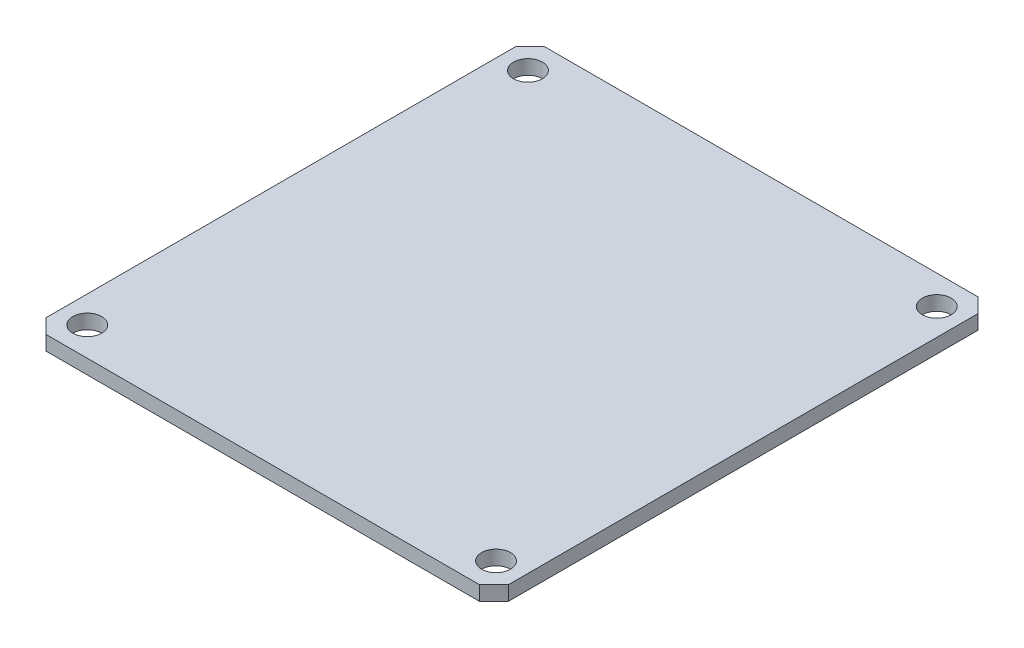
ISO-10303-21;
HEADER;
FILE_DESCRIPTION(('STEP AP214'),'2;1');
FILE_NAME('part.step','',(''),(''),'','','');
FILE_SCHEMA(('AUTOMOTIVE_DESIGN { 1 0 10303 214 1 1 1 1 }'));
ENDSEC;
DATA;
#1=APPLICATION_CONTEXT('core data for automotive mechanical design processes');
#2=APPLICATION_PROTOCOL_DEFINITION('international standard','automotive_design',2000,#1);
#3=PRODUCT_CONTEXT('',#1,'mechanical');
#4=PRODUCT('Part','Part','',(#3));
#5=PRODUCT_RELATED_PRODUCT_CATEGORY('part','',(#4));
#6=PRODUCT_DEFINITION_FORMATION('','',#4);
#7=PRODUCT_DEFINITION_CONTEXT('part definition',#1,'design');
#8=PRODUCT_DEFINITION('design','',#6,#7);
#9=PRODUCT_DEFINITION_SHAPE('','',#8);
#10=(LENGTH_UNIT() NAMED_UNIT(*) SI_UNIT(.MILLI.,.METRE.));
#11=(NAMED_UNIT(*) PLANE_ANGLE_UNIT() SI_UNIT($,.RADIAN.));
#12=(NAMED_UNIT(*) SI_UNIT($,.STERADIAN.) SOLID_ANGLE_UNIT());
#13=UNCERTAINTY_MEASURE_WITH_UNIT(LENGTH_MEASURE(1.E-05),#10,'distance_accuracy_value','');
#14=(GEOMETRIC_REPRESENTATION_CONTEXT(3) GLOBAL_UNCERTAINTY_ASSIGNED_CONTEXT((#13)) GLOBAL_UNIT_ASSIGNED_CONTEXT((#10,
#11,#12)) REPRESENTATION_CONTEXT('',''));
#15=CARTESIAN_POINT('',(0.,0.,0.));
#16=DIRECTION('',(0.,0.,1.));
#17=DIRECTION('',(1.,0.,0.));
#18=AXIS2_PLACEMENT_3D('',#15,#16,#17);
#19=CARTESIAN_POINT('',(0.,2.,0.));
#20=DIRECTION('',(0.,-1.,0.));
#21=DIRECTION('',(0.,0.,-1.));
#22=AXIS2_PLACEMENT_3D('',#19,#20,#21);
#23=PLANE('',#22);
#24=DIRECTION('',(0.,0.,1.));
#25=VECTOR('',#24,1.);
#26=CARTESIAN_POINT('',(-32.,2.,32.5));
#27=LINE('',#26,#25);
#28=CARTESIAN_POINT('',(-32.,2.,-32.5003020228044));
#29=VERTEX_POINT('',#28);
#30=CARTESIAN_POINT('',(-32.,2.,32.5));
#31=VERTEX_POINT('',#30);
#32=EDGE_CURVE('E144',#29,#31,#27,.T.);
#33=ORIENTED_EDGE('',*,*,#32,.T.);
#34=DIRECTION('',(0.707106781186546,0.,0.707106781186549));
#35=VECTOR('',#34,1.);
#36=CARTESIAN_POINT('',(-32.,2.,32.5));
#37=LINE('',#36,#35);
#38=CARTESIAN_POINT('',(-30.,2.,34.5));
#39=VERTEX_POINT('',#38);
#40=EDGE_CURVE('E92',#31,#39,#37,.T.);
#41=ORIENTED_EDGE('',*,*,#40,.T.);
#42=DIRECTION('',(1.,0.,0.));
#43=VECTOR('',#42,1.);
#44=CARTESIAN_POINT('',(-30.,2.,34.5));
#45=LINE('',#44,#43);
#46=CARTESIAN_POINT('',(30.,2.,34.5));
#47=VERTEX_POINT('',#46);
#48=EDGE_CURVE('E159',#39,#47,#45,.T.);
#49=ORIENTED_EDGE('',*,*,#48,.T.);
#50=DIRECTION('',(0.707106781186546,0.,-0.707106781186549));
#51=VECTOR('',#50,1.);
#52=CARTESIAN_POINT('',(30.,2.,34.5));
#53=LINE('',#52,#51);
#54=CARTESIAN_POINT('',(32.,2.,32.5));
#55=VERTEX_POINT('',#54);
#56=EDGE_CURVE('E172',#47,#55,#53,.T.);
#57=ORIENTED_EDGE('',*,*,#56,.T.);
#58=DIRECTION('',(0.,0.,-1.));
#59=VECTOR('',#58,1.);
#60=CARTESIAN_POINT('',(32.,2.,32.5));
#61=LINE('',#60,#59);
#62=CARTESIAN_POINT('',(32.,2.,-32.5));
#63=VERTEX_POINT('',#62);
#64=EDGE_CURVE('E111',#55,#63,#61,.T.);
#65=ORIENTED_EDGE('',*,*,#64,.T.);
#66=DIRECTION('',(-0.707106781186549,0.,-0.707106781186546));
#67=VECTOR('',#66,1.);
#68=CARTESIAN_POINT('',(30.,2.,-34.5));
#69=LINE('',#68,#67);
#70=CARTESIAN_POINT('',(30.,2.,-34.5));
#71=VERTEX_POINT('',#70);
#72=EDGE_CURVE('E105',#63,#71,#69,.T.);
#73=ORIENTED_EDGE('',*,*,#72,.T.);
#74=DIRECTION('',(-1.,0.,0.));
#75=VECTOR('',#74,1.);
#76=CARTESIAN_POINT('',(-30.0003020228045,2.,-34.5));
#77=LINE('',#76,#75);
#78=CARTESIAN_POINT('',(-30.0003020228045,2.,-34.5));
#79=VERTEX_POINT('',#78);
#80=EDGE_CURVE('E109',#71,#79,#77,.T.);
#81=ORIENTED_EDGE('',*,*,#80,.T.);
#82=DIRECTION('',(-0.707106781186544,0.,0.707106781186551));
#83=VECTOR('',#82,1.);
#84=CARTESIAN_POINT('',(-32.,2.,-32.5003020228044));
#85=LINE('',#84,#83);
#86=EDGE_CURVE('E49',#79,#29,#85,.T.);
#87=ORIENTED_EDGE('',*,*,#86,.T.);
#88=EDGE_LOOP('',(#33,#41,#49,#57,#65,#73,#81,#87));
#89=FACE_BOUND('',#88,.T.);
#90=CARTESIAN_POINT('',(-28.2898550724638,2.,-30.5));
#91=DIRECTION('',(0.,1.,0.));
#92=DIRECTION('',(0.,0.,1.));
#93=AXIS2_PLACEMENT_3D('',#90,#91,#92);
#94=CIRCLE('',#93,2.);
#95=CARTESIAN_POINT('',(-28.2898550724638,2.,-28.5));
#96=VERTEX_POINT('',#95);
#97=EDGE_CURVE('E133',#96,#96,#94,.T.);
#98=ORIENTED_EDGE('',*,*,#97,.F.);
#99=EDGE_LOOP('',(#98));
#100=FACE_BOUND('',#99,.T.);
#101=CARTESIAN_POINT('',(28.2895705579567,2.,-30.5001238280928));
#102=DIRECTION('',(0.,1.,0.));
#103=DIRECTION('',(0.,0.,-1.));
#104=AXIS2_PLACEMENT_3D('',#101,#102,#103);
#105=CIRCLE('',#104,2.00000000000001);
#106=CARTESIAN_POINT('',(28.2895705579567,2.,-32.5001238280928));
#107=VERTEX_POINT('',#106);
#108=EDGE_CURVE('E181',#107,#107,#105,.T.);
#109=ORIENTED_EDGE('',*,*,#108,.F.);
#110=EDGE_LOOP('',(#109));
#111=FACE_BOUND('',#110,.T.);
#112=CARTESIAN_POINT('',(-28.2899990045352,2.,30.4997154854243));
#113=DIRECTION('',(0.,1.,0.));
#114=DIRECTION('',(0.,0.,-1.));
#115=AXIS2_PLACEMENT_3D('',#112,#113,#114);
#116=CIRCLE('',#115,2.);
#117=CARTESIAN_POINT('',(-28.2899990045352,2.,28.4997154854243));
#118=VERTEX_POINT('',#117);
#119=EDGE_CURVE('E187',#118,#118,#116,.T.);
#120=ORIENTED_EDGE('',*,*,#119,.F.);
#121=EDGE_LOOP('',(#120));
#122=FACE_BOUND('',#121,.T.);
#123=CARTESIAN_POINT('',(28.2894266246709,2.,30.5001063178421));
#124=DIRECTION('',(0.,1.,0.));
#125=DIRECTION('',(0.,0.,1.));
#126=AXIS2_PLACEMENT_3D('',#123,#124,#125);
#127=CIRCLE('',#126,2.00000000000001);
#128=CARTESIAN_POINT('',(28.2894266246709,2.,32.5001063178421));
#129=VERTEX_POINT('',#128);
#130=EDGE_CURVE('E193',#129,#129,#127,.T.);
#131=ORIENTED_EDGE('',*,*,#130,.F.);
#132=EDGE_LOOP('',(#131));
#133=FACE_BOUND('',#132,.T.);
#134=ADVANCED_FACE('F32',(#89,#100,#111,#122,#133),#23,.F.);
#135=CARTESIAN_POINT('',(0.,0.,0.));
#136=DIRECTION('',(0.,-1.,0.));
#137=DIRECTION('',(0.,0.,-1.));
#138=AXIS2_PLACEMENT_3D('',#135,#136,#137);
#139=PLANE('',#138);
#140=CARTESIAN_POINT('',(-28.2899990045352,0.,30.4997154854243));
#141=DIRECTION('',(0.,1.,0.));
#142=DIRECTION('',(0.,0.,-1.));
#143=AXIS2_PLACEMENT_3D('',#140,#141,#142);
#144=CIRCLE('',#143,2.);
#145=CARTESIAN_POINT('',(-28.2899990045352,0.,28.4997154854243));
#146=VERTEX_POINT('',#145);
#147=EDGE_CURVE('E190',#146,#146,#144,.T.);
#148=ORIENTED_EDGE('',*,*,#147,.T.);
#149=EDGE_LOOP('',(#148));
#150=FACE_BOUND('',#149,.T.);
#151=CARTESIAN_POINT('',(-28.2898550724638,0.,-30.5));
#152=DIRECTION('',(0.,1.,0.));
#153=DIRECTION('',(0.,0.,1.));
#154=AXIS2_PLACEMENT_3D('',#151,#152,#153);
#155=CIRCLE('',#154,2.);
#156=CARTESIAN_POINT('',(-28.2898550724638,0.,-28.5));
#157=VERTEX_POINT('',#156);
#158=EDGE_CURVE('E178',#157,#157,#155,.T.);
#159=ORIENTED_EDGE('',*,*,#158,.T.);
#160=EDGE_LOOP('',(#159));
#161=FACE_BOUND('',#160,.T.);
#162=DIRECTION('',(0.,0.,1.));
#163=VECTOR('',#162,1.);
#164=CARTESIAN_POINT('',(-32.,0.,32.5));
#165=LINE('',#164,#163);
#166=CARTESIAN_POINT('',(-32.,0.,-32.5003020228044));
#167=VERTEX_POINT('',#166);
#168=CARTESIAN_POINT('',(-32.,0.,32.5));
#169=VERTEX_POINT('',#168);
#170=EDGE_CURVE('E129',#167,#169,#165,.T.);
#171=ORIENTED_EDGE('',*,*,#170,.F.);
#172=DIRECTION('',(-0.707106781186544,0.,0.707106781186551));
#173=VECTOR('',#172,1.);
#174=CARTESIAN_POINT('',(-32.,0.,-32.5003020228044));
#175=LINE('',#174,#173);
#176=CARTESIAN_POINT('',(-30.0003020228045,0.,-34.5));
#177=VERTEX_POINT('',#176);
#178=EDGE_CURVE('E84',#177,#167,#175,.T.);
#179=ORIENTED_EDGE('',*,*,#178,.F.);
#180=DIRECTION('',(-1.,0.,0.));
#181=VECTOR('',#180,1.);
#182=CARTESIAN_POINT('',(-30.0003020228045,0.,-34.5));
#183=LINE('',#182,#181);
#184=CARTESIAN_POINT('',(30.,0.,-34.5));
#185=VERTEX_POINT('',#184);
#186=EDGE_CURVE('E78',#185,#177,#183,.T.);
#187=ORIENTED_EDGE('',*,*,#186,.F.);
#188=DIRECTION('',(-0.707106781186549,0.,-0.707106781186546));
#189=VECTOR('',#188,1.);
#190=CARTESIAN_POINT('',(30.,0.,-34.5));
#191=LINE('',#190,#189);
#192=CARTESIAN_POINT('',(32.,0.,-32.5));
#193=VERTEX_POINT('',#192);
#194=EDGE_CURVE('E119',#193,#185,#191,.T.);
#195=ORIENTED_EDGE('',*,*,#194,.F.);
#196=DIRECTION('',(0.,0.,-1.));
#197=VECTOR('',#196,1.);
#198=CARTESIAN_POINT('',(32.,0.,32.5));
#199=LINE('',#198,#197);
#200=CARTESIAN_POINT('',(32.,0.,32.5));
#201=VERTEX_POINT('',#200);
#202=EDGE_CURVE('E139',#201,#193,#199,.T.);
#203=ORIENTED_EDGE('',*,*,#202,.F.);
#204=DIRECTION('',(0.707106781186546,0.,-0.707106781186549));
#205=VECTOR('',#204,1.);
#206=CARTESIAN_POINT('',(30.,0.,34.5));
#207=LINE('',#206,#205);
#208=CARTESIAN_POINT('',(30.,0.,34.5));
#209=VERTEX_POINT('',#208);
#210=EDGE_CURVE('E137',#209,#201,#207,.T.);
#211=ORIENTED_EDGE('',*,*,#210,.F.);
#212=DIRECTION('',(1.,0.,0.));
#213=VECTOR('',#212,1.);
#214=CARTESIAN_POINT('',(-30.,0.,34.5));
#215=LINE('',#214,#213);
#216=CARTESIAN_POINT('',(-30.,0.,34.5));
#217=VERTEX_POINT('',#216);
#218=EDGE_CURVE('E135',#217,#209,#215,.T.);
#219=ORIENTED_EDGE('',*,*,#218,.F.);
#220=DIRECTION('',(0.707106781186546,0.,0.707106781186549));
#221=VECTOR('',#220,1.);
#222=CARTESIAN_POINT('',(-32.,0.,32.5));
#223=LINE('',#222,#221);
#224=EDGE_CURVE('E132',#169,#217,#223,.T.);
#225=ORIENTED_EDGE('',*,*,#224,.F.);
#226=EDGE_LOOP('',(#171,#179,#187,#195,#203,#211,#219,#225));
#227=FACE_BOUND('',#226,.T.);
#228=CARTESIAN_POINT('',(28.2895705579567,0.,-30.5001238280928));
#229=DIRECTION('',(0.,1.,0.));
#230=DIRECTION('',(0.,0.,-1.));
#231=AXIS2_PLACEMENT_3D('',#228,#229,#230);
#232=CIRCLE('',#231,2.00000000000001);
#233=CARTESIAN_POINT('',(28.2895705579567,0.,-32.5001238280928));
#234=VERTEX_POINT('',#233);
#235=EDGE_CURVE('E184',#234,#234,#232,.T.);
#236=ORIENTED_EDGE('',*,*,#235,.T.);
#237=EDGE_LOOP('',(#236));
#238=FACE_BOUND('',#237,.T.);
#239=CARTESIAN_POINT('',(28.2894266246709,0.,30.5001063178421));
#240=DIRECTION('',(0.,1.,0.));
#241=DIRECTION('',(0.,0.,1.));
#242=AXIS2_PLACEMENT_3D('',#239,#240,#241);
#243=CIRCLE('',#242,2.00000000000001);
#244=CARTESIAN_POINT('',(28.2894266246709,0.,32.5001063178421));
#245=VERTEX_POINT('',#244);
#246=EDGE_CURVE('E196',#245,#245,#243,.T.);
#247=ORIENTED_EDGE('',*,*,#246,.T.);
#248=EDGE_LOOP('',(#247));
#249=FACE_BOUND('',#248,.T.);
#250=ADVANCED_FACE('F163',(#150,#161,#227,#238,#249),#139,.T.);
#251=CARTESIAN_POINT('',(-32.,2.,32.5));
#252=DIRECTION('',(1.,0.,0.));
#253=DIRECTION('',(0.,0.,-1.));
#254=AXIS2_PLACEMENT_3D('',#251,#252,#253);
#255=PLANE('',#254);
#256=ORIENTED_EDGE('',*,*,#170,.T.);
#257=DIRECTION('',(0.,-1.,0.));
#258=VECTOR('',#257,1.);
#259=CARTESIAN_POINT('',(-32.,2.,32.5));
#260=LINE('',#259,#258);
#261=EDGE_CURVE('E11',#31,#169,#260,.T.);
#262=ORIENTED_EDGE('',*,*,#261,.F.);
#263=ORIENTED_EDGE('',*,*,#32,.F.);
#264=DIRECTION('',(0.,-1.,0.));
#265=VECTOR('',#264,1.);
#266=CARTESIAN_POINT('',(-32.,2.,-32.5003020228044));
#267=LINE('',#266,#265);
#268=EDGE_CURVE('E125',#29,#167,#267,.T.);
#269=ORIENTED_EDGE('',*,*,#268,.T.);
#270=EDGE_LOOP('',(#256,#262,#263,#269));
#271=FACE_BOUND('',#270,.T.);
#272=ADVANCED_FACE('F34',(#271),#255,.F.);
#273=CARTESIAN_POINT('',(-32.,2.,32.5));
#274=DIRECTION('',(0.707106781186549,0.,-0.707106781186546));
#275=DIRECTION('',(-0.707106781186546,0.,-0.707106781186549));
#276=AXIS2_PLACEMENT_3D('',#273,#274,#275);
#277=PLANE('',#276);
#278=ORIENTED_EDGE('',*,*,#224,.T.);
#279=DIRECTION('',(0.,-1.,0.));
#280=VECTOR('',#279,1.);
#281=CARTESIAN_POINT('',(-30.,2.,34.5));
#282=LINE('',#281,#280);
#283=EDGE_CURVE('E41',#39,#217,#282,.T.);
#284=ORIENTED_EDGE('',*,*,#283,.F.);
#285=ORIENTED_EDGE('',*,*,#40,.F.);
#286=ORIENTED_EDGE('',*,*,#261,.T.);
#287=EDGE_LOOP('',(#278,#284,#285,#286));
#288=FACE_BOUND('',#287,.T.);
#289=ADVANCED_FACE('F228',(#288),#277,.F.);
#290=CARTESIAN_POINT('',(-30.,2.,34.5));
#291=DIRECTION('',(0.,0.,-1.));
#292=DIRECTION('',(-1.,0.,0.));
#293=AXIS2_PLACEMENT_3D('',#290,#291,#292);
#294=PLANE('',#293);
#295=ORIENTED_EDGE('',*,*,#218,.T.);
#296=DIRECTION('',(0.,-1.,0.));
#297=VECTOR('',#296,1.);
#298=CARTESIAN_POINT('',(30.,2.,34.5));
#299=LINE('',#298,#297);
#300=EDGE_CURVE('E151',#47,#209,#299,.T.);
#301=ORIENTED_EDGE('',*,*,#300,.F.);
#302=ORIENTED_EDGE('',*,*,#48,.F.);
#303=ORIENTED_EDGE('',*,*,#283,.T.);
#304=EDGE_LOOP('',(#295,#301,#302,#303));
#305=FACE_BOUND('',#304,.T.);
#306=ADVANCED_FACE('F157',(#305),#294,.F.);
#307=CARTESIAN_POINT('',(30.,2.,34.5));
#308=DIRECTION('',(-0.707106781186549,0.,-0.707106781186546));
#309=DIRECTION('',(-0.707106781186546,0.,0.707106781186549));
#310=AXIS2_PLACEMENT_3D('',#307,#308,#309);
#311=PLANE('',#310);
#312=ORIENTED_EDGE('',*,*,#210,.T.);
#313=DIRECTION('',(0.,-1.,0.));
#314=VECTOR('',#313,1.);
#315=CARTESIAN_POINT('',(32.,2.,32.5));
#316=LINE('',#315,#314);
#317=EDGE_CURVE('E148',#55,#201,#316,.T.);
#318=ORIENTED_EDGE('',*,*,#317,.F.);
#319=ORIENTED_EDGE('',*,*,#56,.F.);
#320=ORIENTED_EDGE('',*,*,#300,.T.);
#321=EDGE_LOOP('',(#312,#318,#319,#320));
#322=FACE_BOUND('',#321,.T.);
#323=ADVANCED_FACE('F168',(#322),#311,.F.);
#324=CARTESIAN_POINT('',(32.,2.,32.5));
#325=DIRECTION('',(-1.,0.,0.));
#326=DIRECTION('',(0.,0.,1.));
#327=AXIS2_PLACEMENT_3D('',#324,#325,#326);
#328=PLANE('',#327);
#329=ORIENTED_EDGE('',*,*,#202,.T.);
#330=DIRECTION('',(0.,-1.,0.));
#331=VECTOR('',#330,1.);
#332=CARTESIAN_POINT('',(32.,2.,-32.5));
#333=LINE('',#332,#331);
#334=EDGE_CURVE('E120',#63,#193,#333,.T.);
#335=ORIENTED_EDGE('',*,*,#334,.F.);
#336=ORIENTED_EDGE('',*,*,#64,.F.);
#337=ORIENTED_EDGE('',*,*,#317,.T.);
#338=EDGE_LOOP('',(#329,#335,#336,#337));
#339=FACE_BOUND('',#338,.T.);
#340=ADVANCED_FACE('F171',(#339),#328,.F.);
#341=CARTESIAN_POINT('',(30.,2.,-34.5));
#342=DIRECTION('',(-0.707106781186546,0.,0.707106781186549));
#343=DIRECTION('',(0.707106781186549,0.,0.707106781186546));
#344=AXIS2_PLACEMENT_3D('',#341,#342,#343);
#345=PLANE('',#344);
#346=ORIENTED_EDGE('',*,*,#194,.T.);
#347=DIRECTION('',(0.,-1.,0.));
#348=VECTOR('',#347,1.);
#349=CARTESIAN_POINT('',(30.,2.,-34.5));
#350=LINE('',#349,#348);
#351=EDGE_CURVE('E116',#71,#185,#350,.T.);
#352=ORIENTED_EDGE('',*,*,#351,.F.);
#353=ORIENTED_EDGE('',*,*,#72,.F.);
#354=ORIENTED_EDGE('',*,*,#334,.T.);
#355=EDGE_LOOP('',(#346,#352,#353,#354));
#356=FACE_BOUND('',#355,.T.);
#357=ADVANCED_FACE('F117',(#356),#345,.F.);
#358=CARTESIAN_POINT('',(-30.0003020228045,2.,-34.5));
#359=DIRECTION('',(0.,0.,1.));
#360=DIRECTION('',(1.,0.,0.));
#361=AXIS2_PLACEMENT_3D('',#358,#359,#360);
#362=PLANE('',#361);
#363=ORIENTED_EDGE('',*,*,#186,.T.);
#364=DIRECTION('',(0.,-1.,0.));
#365=VECTOR('',#364,1.);
#366=CARTESIAN_POINT('',(-30.0003020228045,2.,-34.5));
#367=LINE('',#366,#365);
#368=EDGE_CURVE('E121',#79,#177,#367,.T.);
#369=ORIENTED_EDGE('',*,*,#368,.F.);
#370=ORIENTED_EDGE('',*,*,#80,.F.);
#371=ORIENTED_EDGE('',*,*,#351,.T.);
#372=EDGE_LOOP('',(#363,#369,#370,#371));
#373=FACE_BOUND('',#372,.T.);
#374=ADVANCED_FACE('F123',(#373),#362,.F.);
#375=CARTESIAN_POINT('',(-32.,2.,-32.5003020228044));
#376=DIRECTION('',(0.707106781186551,0.,0.707106781186544));
#377=DIRECTION('',(0.707106781186544,0.,-0.707106781186551));
#378=AXIS2_PLACEMENT_3D('',#375,#376,#377);
#379=PLANE('',#378);
#380=ORIENTED_EDGE('',*,*,#178,.T.);
#381=ORIENTED_EDGE('',*,*,#268,.F.);
#382=ORIENTED_EDGE('',*,*,#86,.F.);
#383=ORIENTED_EDGE('',*,*,#368,.T.);
#384=EDGE_LOOP('',(#380,#381,#382,#383));
#385=FACE_BOUND('',#384,.T.);
#386=ADVANCED_FACE('F216',(#385),#379,.F.);
#387=CARTESIAN_POINT('',(-28.2898550724638,2.,-30.5));
#388=DIRECTION('',(0.,-1.,0.));
#389=DIRECTION('',(0.,0.,-1.));
#390=AXIS2_PLACEMENT_3D('',#387,#388,#389);
#391=CYLINDRICAL_SURFACE('',#390,2.);
#392=ORIENTED_EDGE('',*,*,#97,.T.);
#393=EDGE_LOOP('',(#392));
#394=FACE_BOUND('',#393,.T.);
#395=ORIENTED_EDGE('',*,*,#158,.F.);
#396=EDGE_LOOP('',(#395));
#397=FACE_BOUND('',#396,.T.);
#398=ADVANCED_FACE('F213',(#394,#397),#391,.F.);
#399=CARTESIAN_POINT('',(28.2895705579567,2.,-30.5001238280928));
#400=DIRECTION('',(0.,-1.,0.));
#401=DIRECTION('',(0.,0.,-1.));
#402=AXIS2_PLACEMENT_3D('',#399,#400,#401);
#403=CYLINDRICAL_SURFACE('',#402,2.00000000000001);
#404=ORIENTED_EDGE('',*,*,#108,.T.);
#405=EDGE_LOOP('',(#404));
#406=FACE_BOUND('',#405,.T.);
#407=ORIENTED_EDGE('',*,*,#235,.F.);
#408=EDGE_LOOP('',(#407));
#409=FACE_BOUND('',#408,.T.);
#410=ADVANCED_FACE('F292',(#406,#409),#403,.F.);
#411=CARTESIAN_POINT('',(-28.2899990045352,2.,30.4997154854243));
#412=DIRECTION('',(0.,-1.,0.));
#413=DIRECTION('',(0.,0.,-1.));
#414=AXIS2_PLACEMENT_3D('',#411,#412,#413);
#415=CYLINDRICAL_SURFACE('',#414,2.);
#416=ORIENTED_EDGE('',*,*,#119,.T.);
#417=EDGE_LOOP('',(#416));
#418=FACE_BOUND('',#417,.T.);
#419=ORIENTED_EDGE('',*,*,#147,.F.);
#420=EDGE_LOOP('',(#419));
#421=FACE_BOUND('',#420,.T.);
#422=ADVANCED_FACE('F300',(#418,#421),#415,.F.);
#423=CARTESIAN_POINT('',(28.2894266246709,2.,30.5001063178421));
#424=DIRECTION('',(0.,-1.,0.));
#425=DIRECTION('',(0.,0.,-1.));
#426=AXIS2_PLACEMENT_3D('',#423,#424,#425);
#427=CYLINDRICAL_SURFACE('',#426,2.00000000000001);
#428=ORIENTED_EDGE('',*,*,#130,.T.);
#429=EDGE_LOOP('',(#428));
#430=FACE_BOUND('',#429,.T.);
#431=ORIENTED_EDGE('',*,*,#246,.F.);
#432=EDGE_LOOP('',(#431));
#433=FACE_BOUND('',#432,.T.);
#434=ADVANCED_FACE('F202',(#430,#433),#427,.F.);
#435=CLOSED_SHELL('',(#134,#250,#272,#289,#306,#323,#340,#357,#374,#386,#398,#410,#422,#434));
#436=MANIFOLD_SOLID_BREP('B2',#435);
#437=ADVANCED_BREP_SHAPE_REPRESENTATION('',(#18,#436),#14);
#438=SHAPE_DEFINITION_REPRESENTATION(#9,#437);
ENDSEC;
END-ISO-10303-21;
